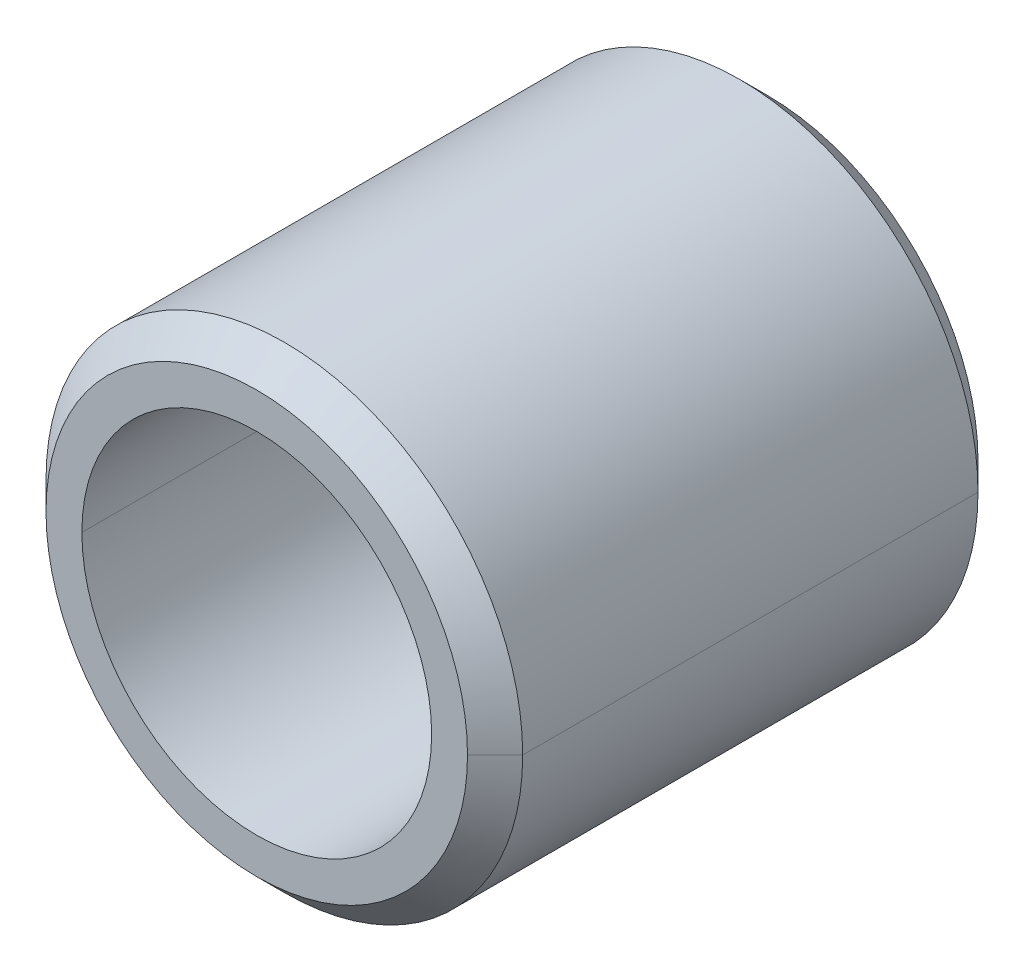
ISO-10303-21;
HEADER;
FILE_DESCRIPTION(('STEP AP214'),'2;1');
FILE_NAME('part.step','',(''),(''),'','','');
FILE_SCHEMA(('AUTOMOTIVE_DESIGN { 1 0 10303 214 1 1 1 1 }'));
ENDSEC;
DATA;
#1=APPLICATION_CONTEXT('core data for automotive mechanical design processes');
#2=APPLICATION_PROTOCOL_DEFINITION('international standard','automotive_design',2000,#1);
#3=PRODUCT_CONTEXT('',#1,'mechanical');
#4=PRODUCT('Part','Part','',(#3));
#5=PRODUCT_RELATED_PRODUCT_CATEGORY('part','',(#4));
#6=PRODUCT_DEFINITION_FORMATION('','',#4);
#7=PRODUCT_DEFINITION_CONTEXT('part definition',#1,'design');
#8=PRODUCT_DEFINITION('design','',#6,#7);
#9=PRODUCT_DEFINITION_SHAPE('','',#8);
#10=(LENGTH_UNIT() NAMED_UNIT(*) SI_UNIT(.MILLI.,.METRE.));
#11=(NAMED_UNIT(*) PLANE_ANGLE_UNIT() SI_UNIT($,.RADIAN.));
#12=(NAMED_UNIT(*) SI_UNIT($,.STERADIAN.) SOLID_ANGLE_UNIT());
#13=UNCERTAINTY_MEASURE_WITH_UNIT(LENGTH_MEASURE(1.E-05),#10,'distance_accuracy_value','');
#14=(GEOMETRIC_REPRESENTATION_CONTEXT(3) GLOBAL_UNCERTAINTY_ASSIGNED_CONTEXT((#13)) GLOBAL_UNIT_ASSIGNED_CONTEXT((#10,
#11,#12)) REPRESENTATION_CONTEXT('',''));
#15=CARTESIAN_POINT('',(0.,0.,0.));
#16=DIRECTION('',(0.,0.,1.));
#17=DIRECTION('',(1.,0.,0.));
#18=AXIS2_PLACEMENT_3D('',#15,#16,#17);
#19=CARTESIAN_POINT('',(0.,3.87985,4.699));
#20=DIRECTION('',(0.,0.,1.));
#21=DIRECTION('',(1.,0.,0.));
#22=AXIS2_PLACEMENT_3D('',#19,#20,#21);
#23=PLANE('',#22);
#24=CARTESIAN_POINT('',(0.,0.,4.699));
#25=DIRECTION('',(0.,0.,-1.));
#26=DIRECTION('',(-1.,0.,0.));
#27=AXIS2_PLACEMENT_3D('',#24,#25,#26);
#28=CIRCLE('',#27,3.21945);
#29=CARTESIAN_POINT('',(-3.21945,0.,4.699));
#30=VERTEX_POINT('',#29);
#31=CARTESIAN_POINT('',(3.21945,0.,4.699));
#32=VERTEX_POINT('',#31);
#33=EDGE_CURVE('E11',#30,#32,#28,.T.);
#34=ORIENTED_EDGE('',*,*,#33,.T.);
#35=CARTESIAN_POINT('',(0.,0.,4.699));
#36=DIRECTION('',(0.,0.,-1.));
#37=DIRECTION('',(-1.,0.,0.));
#38=AXIS2_PLACEMENT_3D('',#35,#36,#37);
#39=CIRCLE('',#38,3.21945);
#40=EDGE_CURVE('E25',#32,#30,#39,.T.);
#41=ORIENTED_EDGE('',*,*,#40,.T.);
#42=EDGE_LOOP('',(#34,#41));
#43=FACE_BOUND('',#42,.T.);
#44=CARTESIAN_POINT('',(0.,0.,4.699));
#45=DIRECTION('',(0.,0.,-1.));
#46=DIRECTION('',(-1.,0.,0.));
#47=AXIS2_PLACEMENT_3D('',#44,#45,#46);
#48=CIRCLE('',#47,3.87985);
#49=CARTESIAN_POINT('',(-3.87985,0.,4.699));
#50=VERTEX_POINT('',#49);
#51=CARTESIAN_POINT('',(3.8798499999987,0.,4.6989999999987));
#52=VERTEX_POINT('',#51);
#53=EDGE_CURVE('E147',#50,#52,#48,.T.);
#54=ORIENTED_EDGE('',*,*,#53,.F.);
#55=CARTESIAN_POINT('',(0.,0.,4.699));
#56=DIRECTION('',(0.,0.,-1.));
#57=DIRECTION('',(-1.,0.,0.));
#58=AXIS2_PLACEMENT_3D('',#55,#56,#57);
#59=CIRCLE('',#58,3.87985);
#60=EDGE_CURVE('E142',#52,#50,#59,.T.);
#61=ORIENTED_EDGE('',*,*,#60,.F.);
#62=EDGE_LOOP('',(#54,#61));
#63=FACE_BOUND('',#62,.T.);
#64=ADVANCED_FACE('F17',(#43,#63),#23,.T.);
#65=CARTESIAN_POINT('',(0.,0.,4.191));
#66=DIRECTION('',(0.,0.,-1.));
#67=DIRECTION('',(0.,1.,0.));
#68=AXIS2_PLACEMENT_3D('',#65,#66,#67);
#69=CONICAL_SURFACE('',#68,4.38785,0.7853981634);
#70=ORIENTED_EDGE('',*,*,#60,.T.);
#71=DIRECTION('',(-0.707106781188353,0.,-0.707106781184743));
#72=VECTOR('',#71,1.);
#73=CARTESIAN_POINT('',(-3.8798499999987,0.,4.6989999999987));
#74=LINE('',#73,#72);
#75=CARTESIAN_POINT('',(-4.38785,0.,4.191));
#76=VERTEX_POINT('',#75);
#77=EDGE_CURVE('E138',#50,#76,#74,.T.);
#78=ORIENTED_EDGE('',*,*,#77,.T.);
#79=CARTESIAN_POINT('',(0.,0.,4.191));
#80=DIRECTION('',(0.,0.,-1.));
#81=DIRECTION('',(-1.,0.,0.));
#82=AXIS2_PLACEMENT_3D('',#79,#80,#81);
#83=CIRCLE('',#82,4.38785);
#84=CARTESIAN_POINT('',(4.38785,0.,4.191));
#85=VERTEX_POINT('',#84);
#86=EDGE_CURVE('E133',#85,#76,#83,.T.);
#87=ORIENTED_EDGE('',*,*,#86,.F.);
#88=DIRECTION('',(0.707106781188353,0.,-0.707106781184743));
#89=VECTOR('',#88,1.);
#90=CARTESIAN_POINT('',(3.8798499999987,0.,4.6989999999987));
#91=LINE('',#90,#89);
#92=EDGE_CURVE('E128',#52,#85,#91,.T.);
#93=ORIENTED_EDGE('',*,*,#92,.F.);
#94=EDGE_LOOP('',(#70,#78,#87,#93));
#95=FACE_BOUND('',#94,.T.);
#96=ADVANCED_FACE('F163',(#95),#69,.T.);
#97=CARTESIAN_POINT('',(0.,0.,4.191));
#98=DIRECTION('',(0.,0.,-1.));
#99=DIRECTION('',(0.,-1.,0.));
#100=AXIS2_PLACEMENT_3D('',#97,#98,#99);
#101=CONICAL_SURFACE('',#100,4.38785,0.7853981634);
#102=CARTESIAN_POINT('',(0.,0.,4.191));
#103=DIRECTION('',(0.,0.,-1.));
#104=DIRECTION('',(-1.,0.,0.));
#105=AXIS2_PLACEMENT_3D('',#102,#103,#104);
#106=CIRCLE('',#105,4.38785);
#107=EDGE_CURVE('E123',#76,#85,#106,.T.);
#108=ORIENTED_EDGE('',*,*,#107,.F.);
#109=ORIENTED_EDGE('',*,*,#77,.F.);
#110=ORIENTED_EDGE('',*,*,#53,.T.);
#111=ORIENTED_EDGE('',*,*,#92,.T.);
#112=EDGE_LOOP('',(#108,#109,#110,#111));
#113=FACE_BOUND('',#112,.T.);
#114=ADVANCED_FACE('F159',(#113),#101,.T.);
#115=CARTESIAN_POINT('',(0.,0.,-4.699));
#116=DIRECTION('',(0.,0.,1.));
#117=DIRECTION('',(0.,-1.,0.));
#118=AXIS2_PLACEMENT_3D('',#115,#116,#117);
#119=CYLINDRICAL_SURFACE('',#118,4.38785);
#120=CARTESIAN_POINT('',(0.,0.,-4.191));
#121=DIRECTION('',(0.,0.,-1.));
#122=DIRECTION('',(-1.,0.,0.));
#123=AXIS2_PLACEMENT_3D('',#120,#121,#122);
#124=CIRCLE('',#123,4.38785);
#125=CARTESIAN_POINT('',(-4.38785,0.,-4.191));
#126=VERTEX_POINT('',#125);
#127=CARTESIAN_POINT('',(4.3878500000013,0.,-4.1910000000013));
#128=VERTEX_POINT('',#127);
#129=EDGE_CURVE('E118',#126,#128,#124,.T.);
#130=ORIENTED_EDGE('',*,*,#129,.F.);
#131=DIRECTION('',(0.,0.,1.));
#132=VECTOR('',#131,1.);
#133=CARTESIAN_POINT('',(-4.38785,0.,-4.191));
#134=LINE('',#133,#132);
#135=EDGE_CURVE('E113',#126,#76,#134,.T.);
#136=ORIENTED_EDGE('',*,*,#135,.T.);
#137=ORIENTED_EDGE('',*,*,#107,.T.);
#138=DIRECTION('',(0.,0.,1.));
#139=VECTOR('',#138,1.);
#140=CARTESIAN_POINT('',(4.38785,0.,-4.191));
#141=LINE('',#140,#139);
#142=EDGE_CURVE('E108',#128,#85,#141,.T.);
#143=ORIENTED_EDGE('',*,*,#142,.F.);
#144=EDGE_LOOP('',(#130,#136,#137,#143));
#145=FACE_BOUND('',#144,.T.);
#146=ADVANCED_FACE('F169',(#145),#119,.T.);
#147=CARTESIAN_POINT('',(0.,0.,-4.699));
#148=DIRECTION('',(0.,0.,1.));
#149=DIRECTION('',(0.,1.,0.));
#150=AXIS2_PLACEMENT_3D('',#147,#148,#149);
#151=CYLINDRICAL_SURFACE('',#150,4.38785);
#152=ORIENTED_EDGE('',*,*,#86,.T.);
#153=ORIENTED_EDGE('',*,*,#135,.F.);
#154=CARTESIAN_POINT('',(0.,0.,-4.191));
#155=DIRECTION('',(0.,0.,-1.));
#156=DIRECTION('',(-1.,0.,0.));
#157=AXIS2_PLACEMENT_3D('',#154,#155,#156);
#158=CIRCLE('',#157,4.38785);
#159=EDGE_CURVE('E103',#128,#126,#158,.T.);
#160=ORIENTED_EDGE('',*,*,#159,.F.);
#161=ORIENTED_EDGE('',*,*,#142,.T.);
#162=EDGE_LOOP('',(#152,#153,#160,#161));
#163=FACE_BOUND('',#162,.T.);
#164=ADVANCED_FACE('F166',(#163),#151,.T.);
#165=CARTESIAN_POINT('',(0.,0.,-4.699));
#166=DIRECTION('',(0.,0.,1.));
#167=DIRECTION('',(0.,1.,0.));
#168=AXIS2_PLACEMENT_3D('',#165,#166,#167);
#169=CONICAL_SURFACE('',#168,3.87985,0.7853981634);
#170=ORIENTED_EDGE('',*,*,#159,.T.);
#171=DIRECTION('',(-0.707106781188353,0.,0.707106781184742));
#172=VECTOR('',#171,1.);
#173=CARTESIAN_POINT('',(-3.87985,0.,-4.699));
#174=LINE('',#173,#172);
#175=CARTESIAN_POINT('',(-3.87985,0.,-4.699));
#176=VERTEX_POINT('',#175);
#177=EDGE_CURVE('E98',#176,#126,#174,.T.);
#178=ORIENTED_EDGE('',*,*,#177,.F.);
#179=CARTESIAN_POINT('',(0.,0.,-4.699));
#180=DIRECTION('',(0.,0.,-1.));
#181=DIRECTION('',(-1.,0.,0.));
#182=AXIS2_PLACEMENT_3D('',#179,#180,#181);
#183=CIRCLE('',#182,3.87985);
#184=CARTESIAN_POINT('',(3.87985,0.,-4.699));
#185=VERTEX_POINT('',#184);
#186=EDGE_CURVE('E93',#185,#176,#183,.T.);
#187=ORIENTED_EDGE('',*,*,#186,.F.);
#188=DIRECTION('',(0.707106781188353,0.,0.707106781184742));
#189=VECTOR('',#188,1.);
#190=CARTESIAN_POINT('',(3.87985,0.,-4.699));
#191=LINE('',#190,#189);
#192=EDGE_CURVE('E82',#185,#128,#191,.T.);
#193=ORIENTED_EDGE('',*,*,#192,.T.);
#194=EDGE_LOOP('',(#170,#178,#187,#193));
#195=FACE_BOUND('',#194,.T.);
#196=ADVANCED_FACE('F175',(#195),#169,.T.);
#197=CARTESIAN_POINT('',(0.,0.,-4.699));
#198=DIRECTION('',(0.,0.,1.));
#199=DIRECTION('',(0.,-1.,0.));
#200=AXIS2_PLACEMENT_3D('',#197,#198,#199);
#201=CONICAL_SURFACE('',#200,3.87985,0.7853981634);
#202=CARTESIAN_POINT('',(0.,0.,-4.699));
#203=DIRECTION('',(0.,0.,-1.));
#204=DIRECTION('',(-1.,0.,0.));
#205=AXIS2_PLACEMENT_3D('',#202,#203,#204);
#206=CIRCLE('',#205,3.87985);
#207=EDGE_CURVE('E79',#176,#185,#206,.T.);
#208=ORIENTED_EDGE('',*,*,#207,.F.);
#209=ORIENTED_EDGE('',*,*,#177,.T.);
#210=ORIENTED_EDGE('',*,*,#129,.T.);
#211=ORIENTED_EDGE('',*,*,#192,.F.);
#212=EDGE_LOOP('',(#208,#209,#210,#211));
#213=FACE_BOUND('',#212,.T.);
#214=ADVANCED_FACE('F173',(#213),#201,.T.);
#215=CARTESIAN_POINT('',(0.,3.21945,-4.699));
#216=DIRECTION('',(0.,0.,-1.));
#217=DIRECTION('',(-1.,0.,0.));
#218=AXIS2_PLACEMENT_3D('',#215,#216,#217);
#219=PLANE('',#218);
#220=ORIENTED_EDGE('',*,*,#207,.T.);
#221=ORIENTED_EDGE('',*,*,#186,.T.);
#222=EDGE_LOOP('',(#220,#221));
#223=FACE_BOUND('',#222,.T.);
#224=CARTESIAN_POINT('',(0.,0.,-4.699));
#225=DIRECTION('',(0.,0.,-1.));
#226=DIRECTION('',(-1.,0.,0.));
#227=AXIS2_PLACEMENT_3D('',#224,#225,#226);
#228=CIRCLE('',#227,3.21945);
#229=CARTESIAN_POINT('',(-3.21945,0.,-4.699));
#230=VERTEX_POINT('',#229);
#231=CARTESIAN_POINT('',(3.21945,0.,-4.699));
#232=VERTEX_POINT('',#231);
#233=EDGE_CURVE('E68',#230,#232,#228,.T.);
#234=ORIENTED_EDGE('',*,*,#233,.F.);
#235=CARTESIAN_POINT('',(0.,0.,-4.699));
#236=DIRECTION('',(0.,0.,-1.));
#237=DIRECTION('',(-1.,0.,0.));
#238=AXIS2_PLACEMENT_3D('',#235,#236,#237);
#239=CIRCLE('',#238,3.21945);
#240=EDGE_CURVE('E64',#232,#230,#239,.T.);
#241=ORIENTED_EDGE('',*,*,#240,.F.);
#242=EDGE_LOOP('',(#234,#241));
#243=FACE_BOUND('',#242,.T.);
#244=ADVANCED_FACE('F66',(#223,#243),#219,.T.);
#245=CARTESIAN_POINT('',(0.,0.,-4.699));
#246=DIRECTION('',(0.,0.,1.));
#247=DIRECTION('',(0.,1.,0.));
#248=AXIS2_PLACEMENT_3D('',#245,#246,#247);
#249=CYLINDRICAL_SURFACE('',#248,3.21945);
#250=ORIENTED_EDGE('',*,*,#40,.F.);
#251=DIRECTION('',(0.,0.,1.));
#252=VECTOR('',#251,1.);
#253=CARTESIAN_POINT('',(3.21945,0.,-4.699));
#254=LINE('',#253,#252);
#255=EDGE_CURVE('E71',#232,#32,#254,.T.);
#256=ORIENTED_EDGE('',*,*,#255,.F.);
#257=ORIENTED_EDGE('',*,*,#240,.T.);
#258=DIRECTION('',(0.,0.,1.));
#259=VECTOR('',#258,1.);
#260=CARTESIAN_POINT('',(-3.21945,0.,-4.699));
#261=LINE('',#260,#259);
#262=EDGE_CURVE('E76',#230,#30,#261,.T.);
#263=ORIENTED_EDGE('',*,*,#262,.T.);
#264=EDGE_LOOP('',(#250,#256,#257,#263));
#265=FACE_BOUND('',#264,.T.);
#266=ADVANCED_FACE('F74',(#265),#249,.F.);
#267=CARTESIAN_POINT('',(0.,0.,-4.699));
#268=DIRECTION('',(0.,0.,1.));
#269=DIRECTION('',(0.,-1.,0.));
#270=AXIS2_PLACEMENT_3D('',#267,#268,#269);
#271=CYLINDRICAL_SURFACE('',#270,3.21945);
#272=ORIENTED_EDGE('',*,*,#233,.T.);
#273=ORIENTED_EDGE('',*,*,#255,.T.);
#274=ORIENTED_EDGE('',*,*,#33,.F.);
#275=ORIENTED_EDGE('',*,*,#262,.F.);
#276=EDGE_LOOP('',(#272,#273,#274,#275));
#277=FACE_BOUND('',#276,.T.);
#278=ADVANCED_FACE('F78',(#277),#271,.F.);
#279=CLOSED_SHELL('',(#64,#96,#114,#146,#164,#196,#214,#244,#266,#278));
#280=MANIFOLD_SOLID_BREP('B1',#279);
#281=ADVANCED_BREP_SHAPE_REPRESENTATION('',(#18,#280),#14);
#282=SHAPE_DEFINITION_REPRESENTATION(#9,#281);
ENDSEC;
END-ISO-10303-21;
